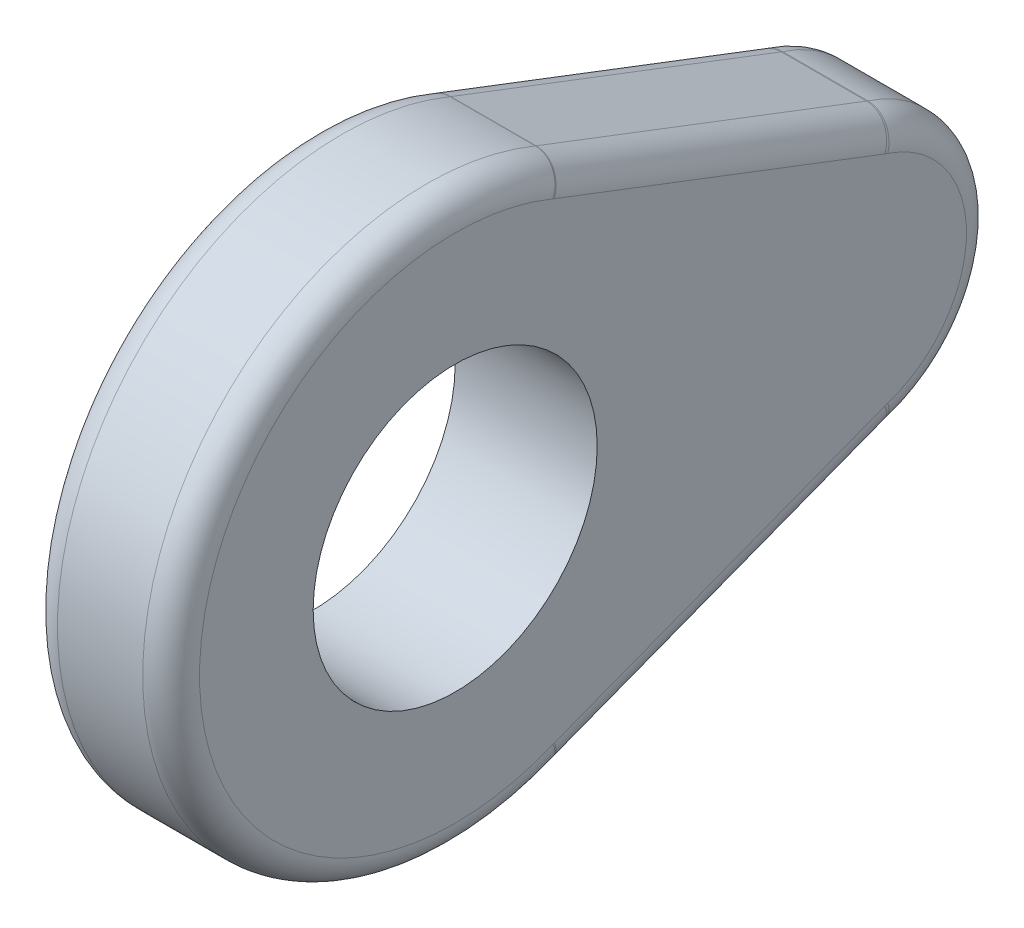
ISO-10303-21;
HEADER;
FILE_DESCRIPTION(('STEP AP214'),'2;1');
FILE_NAME('part.step','',(''),(''),'','','');
FILE_SCHEMA(('AUTOMOTIVE_DESIGN { 1 0 10303 214 1 1 1 1 }'));
ENDSEC;
DATA;
#1=APPLICATION_CONTEXT('core data for automotive mechanical design processes');
#2=APPLICATION_PROTOCOL_DEFINITION('international standard','automotive_design',2000,#1);
#3=PRODUCT_CONTEXT('',#1,'mechanical');
#4=PRODUCT('Part','Part','',(#3));
#5=PRODUCT_RELATED_PRODUCT_CATEGORY('part','',(#4));
#6=PRODUCT_DEFINITION_FORMATION('','',#4);
#7=PRODUCT_DEFINITION_CONTEXT('part definition',#1,'design');
#8=PRODUCT_DEFINITION('design','',#6,#7);
#9=PRODUCT_DEFINITION_SHAPE('','',#8);
#10=(LENGTH_UNIT() NAMED_UNIT(*) SI_UNIT(.MILLI.,.METRE.));
#11=(NAMED_UNIT(*) PLANE_ANGLE_UNIT() SI_UNIT($,.RADIAN.));
#12=(NAMED_UNIT(*) SI_UNIT($,.STERADIAN.) SOLID_ANGLE_UNIT());
#13=UNCERTAINTY_MEASURE_WITH_UNIT(LENGTH_MEASURE(1.E-05),#10,'distance_accuracy_value','');
#14=(GEOMETRIC_REPRESENTATION_CONTEXT(3) GLOBAL_UNCERTAINTY_ASSIGNED_CONTEXT((#13)) GLOBAL_UNIT_ASSIGNED_CONTEXT((#10,
#11,#12)) REPRESENTATION_CONTEXT('',''));
#15=CARTESIAN_POINT('',(0.,0.,0.));
#16=DIRECTION('',(0.,0.,1.));
#17=DIRECTION('',(1.,0.,0.));
#18=AXIS2_PLACEMENT_3D('',#15,#16,#17);
#19=CARTESIAN_POINT('',(0.,0.,0.));
#20=DIRECTION('',(1.,0.,0.));
#21=DIRECTION('',(0.,0.,-1.));
#22=AXIS2_PLACEMENT_3D('',#19,#20,#21);
#23=PLANE('',#22);
#24=CARTESIAN_POINT('',(0.,0.,0.));
#25=DIRECTION('',(1.,0.,0.));
#26=DIRECTION('',(0.,0.,-1.));
#27=AXIS2_PLACEMENT_3D('',#24,#25,#26);
#28=CIRCLE('',#27,5.);
#29=CARTESIAN_POINT('',(0.,0.,-5.));
#30=VERTEX_POINT('',#29);
#31=EDGE_CURVE('E297',#30,#30,#28,.T.);
#32=ORIENTED_EDGE('',*,*,#31,.T.);
#33=EDGE_LOOP('',(#32));
#34=FACE_BOUND('',#33,.T.);
#35=CARTESIAN_POINT('',(0.,-5.71101040658251,-15.8396630495573));
#36=DIRECTION('',(1.,0.,0.));
#37=DIRECTION('',(0.,0.,-1.));
#38=AXIS2_PLACEMENT_3D('',#35,#36,#37);
#39=CIRCLE('',#38,2.);
#40=CARTESIAN_POINT('',(0.,-3.84317430673035,-15.1246887114939));
#41=VERTEX_POINT('',#40);
#42=CARTESIAN_POINT('',(0.,-3.807340271055,-15.2264420330382));
#43=VERTEX_POINT('',#42);
#44=EDGE_CURVE('E214',#41,#43,#39,.F.);
#45=ORIENTED_EDGE('',*,*,#44,.F.);
#46=DIRECTION('',(0.,0.357487169031662,-0.933918049926078));
#47=VECTOR('',#46,1.);
#48=CARTESIAN_POINT('',(0.,-8.40161270135434,-3.21598746286716));
#49=LINE('',#48,#47);
#50=CARTESIAN_POINT('',(0.,-8.29680087797429,-3.48980331467924));
#51=VERTEX_POINT('',#50);
#52=EDGE_CURVE('E211',#41,#51,#49,.F.);
#53=ORIENTED_EDGE('',*,*,#52,.T.);
#54=CARTESIAN_POINT('',(0.,-10.1646369778264,-4.20477765274256));
#55=DIRECTION('',(1.,0.,0.));
#56=DIRECTION('',(0.,0.,-1.));
#57=AXIS2_PLACEMENT_3D('',#54,#55,#56);
#58=CIRCLE('',#57,2.);
#59=CARTESIAN_POINT('',(0.,-8.31652116367618,-3.44027262497118));
#60=VERTEX_POINT('',#59);
#61=EDGE_CURVE('E209',#60,#51,#58,.F.);
#62=ORIENTED_EDGE('',*,*,#61,.F.);
#63=CARTESIAN_POINT('',(0.,0.,0.));
#64=DIRECTION('',(1.,0.,0.));
#65=DIRECTION('',(0.,0.,-1.));
#66=AXIS2_PLACEMENT_3D('',#63,#64,#65);
#67=CIRCLE('',#66,9.);
#68=CARTESIAN_POINT('',(0.,8.31652116367618,-3.44027262497118));
#69=VERTEX_POINT('',#68);
#70=EDGE_CURVE('E207',#60,#69,#67,.F.);
#71=ORIENTED_EDGE('',*,*,#70,.T.);
#72=CARTESIAN_POINT('',(0.,10.1646369778264,-4.20477765274256));
#73=DIRECTION('',(1.,0.,0.));
#74=DIRECTION('',(0.,0.,-1.));
#75=AXIS2_PLACEMENT_3D('',#72,#73,#74);
#76=CIRCLE('',#75,2.);
#77=CARTESIAN_POINT('',(0.,8.29680087797429,-3.48980331467924));
#78=VERTEX_POINT('',#77);
#79=EDGE_CURVE('E204',#78,#69,#76,.F.);
#80=ORIENTED_EDGE('',*,*,#79,.F.);
#81=DIRECTION('',(0.,-0.357487169031662,-0.933918049926078));
#82=VECTOR('',#81,1.);
#83=CARTESIAN_POINT('',(0.,3.83308982371278,-15.151033938764));
#84=LINE('',#83,#82);
#85=CARTESIAN_POINT('',(0.,3.84317430673036,-15.1246887114939));
#86=VERTEX_POINT('',#85);
#87=EDGE_CURVE('E200',#78,#86,#84,.T.);
#88=ORIENTED_EDGE('',*,*,#87,.T.);
#89=CARTESIAN_POINT('',(0.,5.71101040658251,-15.8396630495573));
#90=DIRECTION('',(1.,0.,0.));
#91=DIRECTION('',(0.,0.,-1.));
#92=AXIS2_PLACEMENT_3D('',#89,#90,#91);
#93=CIRCLE('',#92,2.);
#94=CARTESIAN_POINT('',(0.,3.807340271055,-15.2264420330382));
#95=VERTEX_POINT('',#94);
#96=EDGE_CURVE('E197',#95,#86,#93,.F.);
#97=ORIENTED_EDGE('',*,*,#96,.F.);
#98=CARTESIAN_POINT('',(0.,0.,-14.));
#99=DIRECTION('',(1.,0.,0.));
#100=DIRECTION('',(0.,0.,-1.));
#101=AXIS2_PLACEMENT_3D('',#98,#99,#100);
#102=CIRCLE('',#101,4.);
#103=EDGE_CURVE('E202',#95,#43,#102,.F.);
#104=ORIENTED_EDGE('',*,*,#103,.T.);
#105=EDGE_LOOP('',(#45,#53,#62,#71,#80,#88,#97,#104));
#106=FACE_BOUND('',#105,.T.);
#107=ADVANCED_FACE('F35',(#34,#106),#23,.F.);
#108=CARTESIAN_POINT('',(5.,0.,0.));
#109=DIRECTION('',(1.,0.,0.));
#110=DIRECTION('',(0.,0.,-1.));
#111=AXIS2_PLACEMENT_3D('',#108,#109,#110);
#112=PLANE('',#111);
#113=CARTESIAN_POINT('',(5.,0.,0.));
#114=DIRECTION('',(1.,0.,0.));
#115=DIRECTION('',(0.,0.,-1.));
#116=AXIS2_PLACEMENT_3D('',#113,#114,#115);
#117=CIRCLE('',#116,5.);
#118=CARTESIAN_POINT('',(5.,0.,-5.));
#119=VERTEX_POINT('',#118);
#120=EDGE_CURVE('E157',#119,#119,#117,.T.);
#121=ORIENTED_EDGE('',*,*,#120,.F.);
#122=EDGE_LOOP('',(#121));
#123=FACE_BOUND('',#122,.T.);
#124=CARTESIAN_POINT('',(5.,-10.1646369778264,-4.20477765274256));
#125=DIRECTION('',(1.,0.,0.));
#126=DIRECTION('',(0.,0.,-1.));
#127=AXIS2_PLACEMENT_3D('',#124,#125,#126);
#128=CIRCLE('',#127,2.);
#129=CARTESIAN_POINT('',(5.,-8.29680087797429,-3.48980331467924));
#130=VERTEX_POINT('',#129);
#131=CARTESIAN_POINT('',(5.,-8.31652116367618,-3.44027262497118));
#132=VERTEX_POINT('',#131);
#133=EDGE_CURVE('E186',#130,#132,#128,.T.);
#134=ORIENTED_EDGE('',*,*,#133,.F.);
#135=DIRECTION('',(0.,0.357487169031662,-0.933918049926078));
#136=VECTOR('',#135,1.);
#137=CARTESIAN_POINT('',(5.,-3.83308982371278,-15.151033938764));
#138=LINE('',#137,#136);
#139=CARTESIAN_POINT('',(5.,-3.84317430673036,-15.1246887114939));
#140=VERTEX_POINT('',#139);
#141=EDGE_CURVE('E178',#130,#140,#138,.T.);
#142=ORIENTED_EDGE('',*,*,#141,.T.);
#143=CARTESIAN_POINT('',(5.,-5.71101040658251,-15.8396630495573));
#144=DIRECTION('',(1.,0.,0.));
#145=DIRECTION('',(0.,0.,-1.));
#146=AXIS2_PLACEMENT_3D('',#143,#144,#145);
#147=CIRCLE('',#146,2.);
#148=CARTESIAN_POINT('',(5.,-3.807340271055,-15.2264420330382));
#149=VERTEX_POINT('',#148);
#150=EDGE_CURVE('E174',#149,#140,#147,.T.);
#151=ORIENTED_EDGE('',*,*,#150,.F.);
#152=CARTESIAN_POINT('',(5.,0.,-14.));
#153=DIRECTION('',(1.,0.,0.));
#154=DIRECTION('',(0.,0.,-1.));
#155=AXIS2_PLACEMENT_3D('',#152,#153,#154);
#156=CIRCLE('',#155,4.);
#157=CARTESIAN_POINT('',(5.,3.807340271055,-15.2264420330382));
#158=VERTEX_POINT('',#157);
#159=EDGE_CURVE('E175',#149,#158,#156,.T.);
#160=ORIENTED_EDGE('',*,*,#159,.T.);
#161=CARTESIAN_POINT('',(5.,5.71101040658251,-15.8396630495573));
#162=DIRECTION('',(1.,0.,0.));
#163=DIRECTION('',(0.,0.,-1.));
#164=AXIS2_PLACEMENT_3D('',#161,#162,#163);
#165=CIRCLE('',#164,2.);
#166=CARTESIAN_POINT('',(5.,3.84317430673035,-15.1246887114939));
#167=VERTEX_POINT('',#166);
#168=EDGE_CURVE('E180',#167,#158,#165,.T.);
#169=ORIENTED_EDGE('',*,*,#168,.F.);
#170=DIRECTION('',(0.,-0.357487169031662,-0.933918049926078));
#171=VECTOR('',#170,1.);
#172=CARTESIAN_POINT('',(5.,8.40161270135434,-3.21598746286716));
#173=LINE('',#172,#171);
#174=CARTESIAN_POINT('',(5.,8.29680087797429,-3.48980331467924));
#175=VERTEX_POINT('',#174);
#176=EDGE_CURVE('E154',#167,#175,#173,.F.);
#177=ORIENTED_EDGE('',*,*,#176,.T.);
#178=CARTESIAN_POINT('',(5.,10.1646369778264,-4.20477765274256));
#179=DIRECTION('',(1.,0.,0.));
#180=DIRECTION('',(0.,0.,-1.));
#181=AXIS2_PLACEMENT_3D('',#178,#179,#180);
#182=CIRCLE('',#181,2.);
#183=CARTESIAN_POINT('',(5.,8.31652116367618,-3.44027262497118));
#184=VERTEX_POINT('',#183);
#185=EDGE_CURVE('E147',#184,#175,#182,.T.);
#186=ORIENTED_EDGE('',*,*,#185,.F.);
#187=CARTESIAN_POINT('',(5.,0.,0.));
#188=DIRECTION('',(1.,0.,0.));
#189=DIRECTION('',(0.,0.,-1.));
#190=AXIS2_PLACEMENT_3D('',#187,#188,#189);
#191=CIRCLE('',#190,9.);
#192=EDGE_CURVE('E151',#184,#132,#191,.T.);
#193=ORIENTED_EDGE('',*,*,#192,.T.);
#194=EDGE_LOOP('',(#134,#142,#151,#160,#169,#177,#186,#193));
#195=FACE_BOUND('',#194,.T.);
#196=ADVANCED_FACE('F149',(#123,#195),#112,.T.);
#197=CARTESIAN_POINT('',(5.,-9.33553075128042,-3.57347463189882));
#198=DIRECTION('',(0.,0.933918049926078,0.357487169031662));
#199=DIRECTION('',(0.,-0.357487169031662,0.933918049926078));
#200=AXIS2_PLACEMENT_3D('',#197,#198,#199);
#201=PLANE('',#200);
#202=DIRECTION('',(0.,0.357487169031662,-0.933918049926078));
#203=VECTOR('',#202,1.);
#204=CARTESIAN_POINT('',(4.,-9.23559748653462,-3.83454548371973));
#205=LINE('',#204,#203);
#206=CARTESIAN_POINT('',(4.,-4.77709235665643,-15.4821758805256));
#207=VERTEX_POINT('',#206);
#208=CARTESIAN_POINT('',(4.,-9.23071892790037,-3.8472904837109));
#209=VERTEX_POINT('',#208);
#210=EDGE_CURVE('E192',#207,#209,#205,.F.);
#211=ORIENTED_EDGE('',*,*,#210,.T.);
#212=DIRECTION('',(1.,0.,0.));
#213=VECTOR('',#212,1.);
#214=CARTESIAN_POINT('',(0.,-9.23071892790037,-3.8472904837109));
#215=LINE('',#214,#213);
#216=CARTESIAN_POINT('',(1.,-9.23071892790037,-3.8472904837109));
#217=VERTEX_POINT('',#216);
#218=EDGE_CURVE('E195',#209,#217,#215,.F.);
#219=ORIENTED_EDGE('',*,*,#218,.T.);
#220=DIRECTION('',(0.,0.357487169031662,-0.933918049926078));
#221=VECTOR('',#220,1.);
#222=CARTESIAN_POINT('',(1.,-9.33553075128042,-3.57347463189882));
#223=LINE('',#222,#221);
#224=CARTESIAN_POINT('',(1.,-4.77709235665643,-15.4821758805256));
#225=VERTEX_POINT('',#224);
#226=EDGE_CURVE('E190',#217,#225,#223,.T.);
#227=ORIENTED_EDGE('',*,*,#226,.T.);
#228=DIRECTION('',(1.,0.,0.));
#229=VECTOR('',#228,1.);
#230=CARTESIAN_POINT('',(5.,-4.77709235665643,-15.4821758805256));
#231=LINE('',#230,#229);
#232=EDGE_CURVE('E188',#225,#207,#231,.T.);
#233=ORIENTED_EDGE('',*,*,#232,.T.);
#234=EDGE_LOOP('',(#211,#219,#227,#233));
#235=FACE_BOUND('',#234,.T.);
#236=ADVANCED_FACE('F330',(#235),#201,.F.);
#237=CARTESIAN_POINT('',(5.,0.,-14.));
#238=DIRECTION('',(-1.,0.,0.));
#239=DIRECTION('',(0.,0.,1.));
#240=AXIS2_PLACEMENT_3D('',#237,#238,#239);
#241=CYLINDRICAL_SURFACE('',#240,5.);
#242=CARTESIAN_POINT('',(4.,0.,-14.));
#243=DIRECTION('',(1.,0.,0.));
#244=DIRECTION('',(0.,0.,-1.));
#245=AXIS2_PLACEMENT_3D('',#242,#243,#244);
#246=CIRCLE('',#245,5.);
#247=CARTESIAN_POINT('',(4.,4.75917533881876,-15.5330525412977));
#248=VERTEX_POINT('',#247);
#249=CARTESIAN_POINT('',(4.,-4.75917533881876,-15.5330525412977));
#250=VERTEX_POINT('',#249);
#251=EDGE_CURVE('E44',#248,#250,#246,.F.);
#252=ORIENTED_EDGE('',*,*,#251,.T.);
#253=DIRECTION('',(-1.,0.,0.));
#254=VECTOR('',#253,1.);
#255=CARTESIAN_POINT('',(5.,-4.75917533881876,-15.5330525412977));
#256=LINE('',#255,#254);
#257=CARTESIAN_POINT('',(1.,-4.75917533881876,-15.5330525412977));
#258=VERTEX_POINT('',#257);
#259=EDGE_CURVE('E11',#250,#258,#256,.T.);
#260=ORIENTED_EDGE('',*,*,#259,.T.);
#261=CARTESIAN_POINT('',(1.,0.,-14.));
#262=DIRECTION('',(1.,0.,0.));
#263=DIRECTION('',(0.,0.,-1.));
#264=AXIS2_PLACEMENT_3D('',#261,#262,#263);
#265=CIRCLE('',#264,5.);
#266=CARTESIAN_POINT('',(1.,4.75917533881876,-15.5330525412977));
#267=VERTEX_POINT('',#266);
#268=EDGE_CURVE('E235',#258,#267,#265,.T.);
#269=ORIENTED_EDGE('',*,*,#268,.T.);
#270=DIRECTION('',(-1.,0.,0.));
#271=VECTOR('',#270,1.);
#272=CARTESIAN_POINT('',(5.,4.75917533881876,-15.5330525412977));
#273=LINE('',#272,#271);
#274=EDGE_CURVE('E55',#267,#248,#273,.F.);
#275=ORIENTED_EDGE('',*,*,#274,.T.);
#276=EDGE_LOOP('',(#252,#260,#269,#275));
#277=FACE_BOUND('',#276,.T.);
#278=ADVANCED_FACE('F347',(#277),#241,.T.);
#279=CARTESIAN_POINT('',(5.,9.33553075128042,-3.57347463189882));
#280=DIRECTION('',(0.,0.933918049926078,-0.357487169031662));
#281=DIRECTION('',(0.,0.357487169031662,0.933918049926078));
#282=AXIS2_PLACEMENT_3D('',#279,#280,#281);
#283=PLANE('',#282);
#284=DIRECTION('',(-1.,0.,0.));
#285=VECTOR('',#284,1.);
#286=CARTESIAN_POINT('',(5.,4.77709235665643,-15.4821758805256));
#287=LINE('',#286,#285);
#288=CARTESIAN_POINT('',(4.,4.77709235665643,-15.4821758805256));
#289=VERTEX_POINT('',#288);
#290=CARTESIAN_POINT('',(1.,4.77709235665643,-15.4821758805256));
#291=VERTEX_POINT('',#290);
#292=EDGE_CURVE('E228',#289,#291,#287,.T.);
#293=ORIENTED_EDGE('',*,*,#292,.T.);
#294=DIRECTION('',(0.,-0.357487169031662,-0.933918049926078));
#295=VECTOR('',#294,1.);
#296=CARTESIAN_POINT('',(1.,9.23559748653462,-3.83454548371973));
#297=LINE('',#296,#295);
#298=CARTESIAN_POINT('',(1.,9.23071892790037,-3.8472904837109));
#299=VERTEX_POINT('',#298);
#300=EDGE_CURVE('E233',#291,#299,#297,.F.);
#301=ORIENTED_EDGE('',*,*,#300,.T.);
#302=DIRECTION('',(-1.,0.,0.));
#303=VECTOR('',#302,1.);
#304=CARTESIAN_POINT('',(5.,9.23071892790037,-3.8472904837109));
#305=LINE('',#304,#303);
#306=CARTESIAN_POINT('',(4.,9.23071892790037,-3.8472904837109));
#307=VERTEX_POINT('',#306);
#308=EDGE_CURVE('E230',#299,#307,#305,.F.);
#309=ORIENTED_EDGE('',*,*,#308,.T.);
#310=DIRECTION('',(0.,-0.357487169031662,-0.933918049926078));
#311=VECTOR('',#310,1.);
#312=CARTESIAN_POINT('',(4.,9.33553075128042,-3.57347463189882));
#313=LINE('',#312,#311);
#314=EDGE_CURVE('E226',#307,#289,#313,.T.);
#315=ORIENTED_EDGE('',*,*,#314,.T.);
#316=EDGE_LOOP('',(#293,#301,#309,#315));
#317=FACE_BOUND('',#316,.T.);
#318=ADVANCED_FACE('F349',(#317),#283,.T.);
#319=CARTESIAN_POINT('',(5.,0.,0.));
#320=DIRECTION('',(-1.,0.,0.));
#321=DIRECTION('',(0.,0.,1.));
#322=AXIS2_PLACEMENT_3D('',#319,#320,#321);
#323=CYLINDRICAL_SURFACE('',#322,10.);
#324=CARTESIAN_POINT('',(4.,0.,0.));
#325=DIRECTION('',(1.,0.,0.));
#326=DIRECTION('',(0.,0.,-1.));
#327=AXIS2_PLACEMENT_3D('',#324,#325,#326);
#328=CIRCLE('',#327,10.);
#329=CARTESIAN_POINT('',(4.,-9.24057907075131,-3.82252513885687));
#330=VERTEX_POINT('',#329);
#331=CARTESIAN_POINT('',(4.,9.24057907075131,-3.82252513885687));
#332=VERTEX_POINT('',#331);
#333=EDGE_CURVE('E221',#330,#332,#328,.F.);
#334=ORIENTED_EDGE('',*,*,#333,.T.);
#335=DIRECTION('',(-1.,0.,0.));
#336=VECTOR('',#335,1.);
#337=CARTESIAN_POINT('',(5.,9.24057907075131,-3.82252513885687));
#338=LINE('',#337,#336);
#339=CARTESIAN_POINT('',(1.,9.24057907075131,-3.82252513885687));
#340=VERTEX_POINT('',#339);
#341=EDGE_CURVE('E223',#332,#340,#338,.T.);
#342=ORIENTED_EDGE('',*,*,#341,.T.);
#343=CARTESIAN_POINT('',(1.,0.,0.));
#344=DIRECTION('',(1.,0.,0.));
#345=DIRECTION('',(0.,0.,-1.));
#346=AXIS2_PLACEMENT_3D('',#343,#344,#345);
#347=CIRCLE('',#346,10.);
#348=CARTESIAN_POINT('',(1.,-9.24057907075131,-3.82252513885687));
#349=VERTEX_POINT('',#348);
#350=EDGE_CURVE('E217',#340,#349,#347,.T.);
#351=ORIENTED_EDGE('',*,*,#350,.T.);
#352=DIRECTION('',(-1.,0.,0.));
#353=VECTOR('',#352,1.);
#354=CARTESIAN_POINT('',(5.,-9.24057907075131,-3.82252513885687));
#355=LINE('',#354,#353);
#356=EDGE_CURVE('E219',#349,#330,#355,.F.);
#357=ORIENTED_EDGE('',*,*,#356,.T.);
#358=EDGE_LOOP('',(#334,#342,#351,#357));
#359=FACE_BOUND('',#358,.T.);
#360=ADVANCED_FACE('F355',(#359),#323,.T.);
#361=CARTESIAN_POINT('',(5.,0.,0.));
#362=DIRECTION('',(-1.,0.,0.));
#363=DIRECTION('',(0.,0.,1.));
#364=AXIS2_PLACEMENT_3D('',#361,#362,#363);
#365=CYLINDRICAL_SURFACE('',#364,5.);
#366=ORIENTED_EDGE('',*,*,#120,.T.);
#367=EDGE_LOOP('',(#366));
#368=FACE_BOUND('',#367,.T.);
#369=ORIENTED_EDGE('',*,*,#31,.F.);
#370=EDGE_LOOP('',(#369));
#371=FACE_BOUND('',#370,.T.);
#372=ADVANCED_FACE('F368',(#368,#371),#365,.F.);
#373=CARTESIAN_POINT('',(1.,8.40161270135434,-3.21598746286716));
#374=DIRECTION('',(0.,0.357487169031662,0.933918049926078));
#375=DIRECTION('',(0.,-0.933918049926078,0.357487169031662));
#376=AXIS2_PLACEMENT_3D('',#373,#374,#375);
#377=CYLINDRICAL_SURFACE('',#376,1.);
#378=CARTESIAN_POINT('',(1.,3.84317430673036,-15.1246887114939));
#379=DIRECTION('',(0.,-0.357487169031661,-0.933918049926078));
#380=DIRECTION('',(0.,0.933918049926078,-0.357487169031661));
#381=AXIS2_PLACEMENT_3D('',#378,#379,#380);
#382=CIRCLE('',#381,1.);
#383=EDGE_CURVE('E291',#86,#291,#382,.T.);
#384=ORIENTED_EDGE('',*,*,#383,.F.);
#385=ORIENTED_EDGE('',*,*,#87,.F.);
#386=CARTESIAN_POINT('',(1.,8.29680087797429,-3.48980331467924));
#387=DIRECTION('',(0.,0.357487169031662,0.933918049926078));
#388=DIRECTION('',(0.,-0.933918049926078,0.357487169031662));
#389=AXIS2_PLACEMENT_3D('',#386,#387,#388);
#390=CIRCLE('',#389,1.);
#391=EDGE_CURVE('E39',#299,#78,#390,.T.);
#392=ORIENTED_EDGE('',*,*,#391,.F.);
#393=ORIENTED_EDGE('',*,*,#300,.F.);
#394=EDGE_LOOP('',(#384,#385,#392,#393));
#395=FACE_BOUND('',#394,.T.);
#396=ADVANCED_FACE('F37',(#395),#377,.T.);
#397=CARTESIAN_POINT('',(1.,10.1646369778264,-4.20477765274256));
#398=DIRECTION('',(1.,0.,0.));
#399=DIRECTION('',(0.,0.,-1.));
#400=AXIS2_PLACEMENT_3D('',#397,#398,#399);
#401=TOROIDAL_SURFACE('',#400,2.,1.);
#402=ORIENTED_EDGE('',*,*,#391,.T.);
#403=ORIENTED_EDGE('',*,*,#79,.T.);
#404=CARTESIAN_POINT('',(1.,8.31652116367618,-3.44027262497118));
#405=DIRECTION('',(0.,-0.382252513885687,-0.924057907075131));
#406=DIRECTION('',(0.,0.924057907075132,-0.382252513885687));
#407=AXIS2_PLACEMENT_3D('',#404,#405,#406);
#408=CIRCLE('',#407,1.);
#409=EDGE_CURVE('E289',#340,#69,#408,.F.);
#410=ORIENTED_EDGE('',*,*,#409,.F.);
#411=CARTESIAN_POINT('',(1.,10.1646369778264,-4.20477765274256));
#412=DIRECTION('',(1.,0.,0.));
#413=DIRECTION('',(0.,0.,-1.));
#414=AXIS2_PLACEMENT_3D('',#411,#412,#413);
#415=CIRCLE('',#414,1.);
#416=EDGE_CURVE('E286',#299,#340,#415,.F.);
#417=ORIENTED_EDGE('',*,*,#416,.F.);
#418=EDGE_LOOP('',(#402,#403,#410,#417));
#419=FACE_BOUND('',#418,.T.);
#420=ADVANCED_FACE('F384',(#419),#401,.T.);
#421=CARTESIAN_POINT('',(1.,5.71101040658251,-15.8396630495573));
#422=DIRECTION('',(1.,0.,0.));
#423=DIRECTION('',(0.,0.,-1.));
#424=AXIS2_PLACEMENT_3D('',#421,#422,#423);
#425=TOROIDAL_SURFACE('',#424,2.,1.);
#426=ORIENTED_EDGE('',*,*,#96,.T.);
#427=ORIENTED_EDGE('',*,*,#383,.T.);
#428=CARTESIAN_POINT('',(1.,5.71101040658251,-15.8396630495573));
#429=DIRECTION('',(1.,0.,0.));
#430=DIRECTION('',(0.,0.,-1.));
#431=AXIS2_PLACEMENT_3D('',#428,#429,#430);
#432=CIRCLE('',#431,1.);
#433=EDGE_CURVE('E283',#267,#291,#432,.F.);
#434=ORIENTED_EDGE('',*,*,#433,.F.);
#435=CARTESIAN_POINT('',(1.,3.807340271055,-15.2264420330382));
#436=DIRECTION('',(0.,0.306610508259543,0.951835067763751));
#437=DIRECTION('',(0.,-0.951835067763751,0.306610508259543));
#438=AXIS2_PLACEMENT_3D('',#435,#436,#437);
#439=CIRCLE('',#438,1.);
#440=EDGE_CURVE('E280',#95,#267,#439,.F.);
#441=ORIENTED_EDGE('',*,*,#440,.F.);
#442=EDGE_LOOP('',(#426,#427,#434,#441));
#443=FACE_BOUND('',#442,.T.);
#444=ADVANCED_FACE('F436',(#443),#425,.T.);
#445=CARTESIAN_POINT('',(1.,0.,0.));
#446=DIRECTION('',(1.,0.,0.));
#447=DIRECTION('',(0.,0.,-1.));
#448=AXIS2_PLACEMENT_3D('',#445,#446,#447);
#449=TOROIDAL_SURFACE('',#448,9.,1.);
#450=ORIENTED_EDGE('',*,*,#409,.T.);
#451=ORIENTED_EDGE('',*,*,#70,.F.);
#452=CARTESIAN_POINT('',(1.,-8.31652116367618,-3.44027262497118));
#453=DIRECTION('',(0.,0.382252513885687,-0.924057907075131));
#454=DIRECTION('',(0.,0.924057907075132,0.382252513885687));
#455=AXIS2_PLACEMENT_3D('',#452,#453,#454);
#456=CIRCLE('',#455,1.);
#457=EDGE_CURVE('E274',#349,#60,#456,.T.);
#458=ORIENTED_EDGE('',*,*,#457,.F.);
#459=ORIENTED_EDGE('',*,*,#350,.F.);
#460=EDGE_LOOP('',(#450,#451,#458,#459));
#461=FACE_BOUND('',#460,.T.);
#462=ADVANCED_FACE('F387',(#461),#449,.T.);
#463=CARTESIAN_POINT('',(5.,10.1646369778264,-4.20477765274256));
#464=DIRECTION('',(-1.,0.,0.));
#465=DIRECTION('',(0.,0.,1.));
#466=AXIS2_PLACEMENT_3D('',#463,#464,#465);
#467=CYLINDRICAL_SURFACE('',#466,1.);
#468=ORIENTED_EDGE('',*,*,#416,.T.);
#469=ORIENTED_EDGE('',*,*,#341,.F.);
#470=CARTESIAN_POINT('',(4.,10.1646369778264,-4.20477765274256));
#471=DIRECTION('',(1.,0.,0.));
#472=DIRECTION('',(0.,0.,-1.));
#473=AXIS2_PLACEMENT_3D('',#470,#471,#472);
#474=CIRCLE('',#473,1.);
#475=EDGE_CURVE('E164',#307,#332,#474,.F.);
#476=ORIENTED_EDGE('',*,*,#475,.F.);
#477=ORIENTED_EDGE('',*,*,#308,.F.);
#478=EDGE_LOOP('',(#468,#469,#476,#477));
#479=FACE_BOUND('',#478,.T.);
#480=ADVANCED_FACE('F380',(#479),#467,.F.);
#481=CARTESIAN_POINT('',(4.,8.40161270135434,-3.21598746286716));
#482=DIRECTION('',(0.,-0.357487169031662,-0.933918049926078));
#483=DIRECTION('',(0.,0.933918049926078,-0.357487169031662));
#484=AXIS2_PLACEMENT_3D('',#481,#482,#483);
#485=CYLINDRICAL_SURFACE('',#484,1.);
#486=CARTESIAN_POINT('',(4.,3.84317430673035,-15.1246887114939));
#487=DIRECTION('',(0.,-0.357487169031662,-0.933918049926078));
#488=DIRECTION('',(0.,0.933918049926078,-0.357487169031662));
#489=AXIS2_PLACEMENT_3D('',#486,#487,#488);
#490=CIRCLE('',#489,1.);
#491=EDGE_CURVE('E268',#289,#167,#490,.T.);
#492=ORIENTED_EDGE('',*,*,#491,.F.);
#493=ORIENTED_EDGE('',*,*,#314,.F.);
#494=CARTESIAN_POINT('',(4.,8.29680087797429,-3.48980331467924));
#495=DIRECTION('',(0.,0.357487169031662,0.933918049926078));
#496=DIRECTION('',(0.,-0.933918049926078,0.357487169031662));
#497=AXIS2_PLACEMENT_3D('',#494,#495,#496);
#498=CIRCLE('',#497,1.);
#499=EDGE_CURVE('E271',#175,#307,#498,.T.);
#500=ORIENTED_EDGE('',*,*,#499,.F.);
#501=ORIENTED_EDGE('',*,*,#176,.F.);
#502=EDGE_LOOP('',(#492,#493,#500,#501));
#503=FACE_BOUND('',#502,.T.);
#504=ADVANCED_FACE('F427',(#503),#485,.T.);
#505=CARTESIAN_POINT('',(5.,5.71101040658251,-15.8396630495573));
#506=DIRECTION('',(-1.,0.,0.));
#507=DIRECTION('',(0.,0.,1.));
#508=AXIS2_PLACEMENT_3D('',#505,#506,#507);
#509=CYLINDRICAL_SURFACE('',#508,1.);
#510=ORIENTED_EDGE('',*,*,#433,.T.);
#511=ORIENTED_EDGE('',*,*,#292,.F.);
#512=CARTESIAN_POINT('',(4.,5.71101040658251,-15.8396630495573));
#513=DIRECTION('',(1.,0.,0.));
#514=DIRECTION('',(0.,0.,-1.));
#515=AXIS2_PLACEMENT_3D('',#512,#513,#514);
#516=CIRCLE('',#515,1.);
#517=EDGE_CURVE('E265',#248,#289,#516,.F.);
#518=ORIENTED_EDGE('',*,*,#517,.F.);
#519=ORIENTED_EDGE('',*,*,#274,.F.);
#520=EDGE_LOOP('',(#510,#511,#518,#519));
#521=FACE_BOUND('',#520,.T.);
#522=ADVANCED_FACE('F424',(#521),#509,.F.);
#523=CARTESIAN_POINT('',(1.,0.,-14.));
#524=DIRECTION('',(1.,0.,0.));
#525=DIRECTION('',(0.,0.,-1.));
#526=AXIS2_PLACEMENT_3D('',#523,#524,#525);
#527=TOROIDAL_SURFACE('',#526,4.,1.);
#528=ORIENTED_EDGE('',*,*,#440,.T.);
#529=ORIENTED_EDGE('',*,*,#268,.F.);
#530=CARTESIAN_POINT('',(1.,-3.807340271055,-15.2264420330382));
#531=DIRECTION('',(0.,-0.306610508259543,0.951835067763751));
#532=DIRECTION('',(0.,-0.951835067763751,-0.306610508259543));
#533=AXIS2_PLACEMENT_3D('',#530,#531,#532);
#534=CIRCLE('',#533,1.);
#535=EDGE_CURVE('E262',#43,#258,#534,.T.);
#536=ORIENTED_EDGE('',*,*,#535,.F.);
#537=ORIENTED_EDGE('',*,*,#103,.F.);
#538=EDGE_LOOP('',(#528,#529,#536,#537));
#539=FACE_BOUND('',#538,.T.);
#540=ADVANCED_FACE('F345',(#539),#527,.T.);
#541=CARTESIAN_POINT('',(1.,-8.40161270135434,-3.21598746286716));
#542=DIRECTION('',(0.,0.357487169031662,-0.933918049926078));
#543=DIRECTION('',(0.,0.933918049926078,0.357487169031662));
#544=AXIS2_PLACEMENT_3D('',#541,#542,#543);
#545=CYLINDRICAL_SURFACE('',#544,1.);
#546=CARTESIAN_POINT('',(1.,-8.29680087797429,-3.48980331467924));
#547=DIRECTION('',(0.,-0.357487169031662,0.933918049926078));
#548=DIRECTION('',(0.,-0.933918049926078,-0.357487169031662));
#549=AXIS2_PLACEMENT_3D('',#546,#547,#548);
#550=CIRCLE('',#549,1.);
#551=EDGE_CURVE('E277',#51,#217,#550,.T.);
#552=ORIENTED_EDGE('',*,*,#551,.F.);
#553=ORIENTED_EDGE('',*,*,#52,.F.);
#554=CARTESIAN_POINT('',(1.,-3.84317430673035,-15.1246887114939));
#555=DIRECTION('',(0.,0.357487169031662,-0.933918049926078));
#556=DIRECTION('',(0.,0.933918049926078,0.357487169031662));
#557=AXIS2_PLACEMENT_3D('',#554,#555,#556);
#558=CIRCLE('',#557,1.);
#559=EDGE_CURVE('E259',#225,#41,#558,.T.);
#560=ORIENTED_EDGE('',*,*,#559,.F.);
#561=ORIENTED_EDGE('',*,*,#226,.F.);
#562=EDGE_LOOP('',(#552,#553,#560,#561));
#563=FACE_BOUND('',#562,.T.);
#564=ADVANCED_FACE('F338',(#563),#545,.T.);
#565=CARTESIAN_POINT('',(1.,-10.1646369778264,-4.20477765274256));
#566=DIRECTION('',(1.,0.,0.));
#567=DIRECTION('',(0.,0.,-1.));
#568=AXIS2_PLACEMENT_3D('',#565,#566,#567);
#569=TOROIDAL_SURFACE('',#568,2.,1.);
#570=ORIENTED_EDGE('',*,*,#61,.T.);
#571=ORIENTED_EDGE('',*,*,#551,.T.);
#572=CARTESIAN_POINT('',(1.,-10.1646369778264,-4.20477765274256));
#573=DIRECTION('',(1.,0.,0.));
#574=DIRECTION('',(0.,0.,-1.));
#575=AXIS2_PLACEMENT_3D('',#572,#573,#574);
#576=CIRCLE('',#575,1.);
#577=EDGE_CURVE('E167',#349,#217,#576,.F.);
#578=ORIENTED_EDGE('',*,*,#577,.F.);
#579=ORIENTED_EDGE('',*,*,#457,.T.);
#580=EDGE_LOOP('',(#570,#571,#578,#579));
#581=FACE_BOUND('',#580,.T.);
#582=ADVANCED_FACE('F391',(#581),#569,.T.);
#583=CARTESIAN_POINT('',(4.,10.1646369778264,-4.20477765274256));
#584=DIRECTION('',(1.,0.,0.));
#585=DIRECTION('',(0.,0.,-1.));
#586=AXIS2_PLACEMENT_3D('',#583,#584,#585);
#587=TOROIDAL_SURFACE('',#586,2.,1.);
#588=ORIENTED_EDGE('',*,*,#499,.T.);
#589=ORIENTED_EDGE('',*,*,#475,.T.);
#590=CARTESIAN_POINT('',(4.,8.31652116367618,-3.44027262497118));
#591=DIRECTION('',(0.,-0.382252513885687,-0.924057907075131));
#592=DIRECTION('',(0.,0.924057907075132,-0.382252513885687));
#593=AXIS2_PLACEMENT_3D('',#590,#591,#592);
#594=CIRCLE('',#593,1.);
#595=EDGE_CURVE('E161',#184,#332,#594,.F.);
#596=ORIENTED_EDGE('',*,*,#595,.F.);
#597=ORIENTED_EDGE('',*,*,#185,.T.);
#598=EDGE_LOOP('',(#588,#589,#596,#597));
#599=FACE_BOUND('',#598,.T.);
#600=ADVANCED_FACE('F162',(#599),#587,.T.);
#601=CARTESIAN_POINT('',(4.,5.71101040658251,-15.8396630495573));
#602=DIRECTION('',(1.,0.,0.));
#603=DIRECTION('',(0.,0.,-1.));
#604=AXIS2_PLACEMENT_3D('',#601,#602,#603);
#605=TOROIDAL_SURFACE('',#604,2.,1.);
#606=ORIENTED_EDGE('',*,*,#491,.T.);
#607=ORIENTED_EDGE('',*,*,#168,.T.);
#608=CARTESIAN_POINT('',(4.,3.807340271055,-15.2264420330382));
#609=DIRECTION('',(0.,0.306610508259543,0.951835067763751));
#610=DIRECTION('',(0.,-0.951835067763751,0.306610508259543));
#611=AXIS2_PLACEMENT_3D('',#608,#609,#610);
#612=CIRCLE('',#611,1.);
#613=EDGE_CURVE('E168',#248,#158,#612,.F.);
#614=ORIENTED_EDGE('',*,*,#613,.F.);
#615=ORIENTED_EDGE('',*,*,#517,.T.);
#616=EDGE_LOOP('',(#606,#607,#614,#615));
#617=FACE_BOUND('',#616,.T.);
#618=ADVANCED_FACE('F311',(#617),#605,.T.);
#619=CARTESIAN_POINT('',(1.,-5.71101040658251,-15.8396630495573));
#620=DIRECTION('',(1.,0.,0.));
#621=DIRECTION('',(0.,0.,-1.));
#622=AXIS2_PLACEMENT_3D('',#619,#620,#621);
#623=TOROIDAL_SURFACE('',#622,2.,1.);
#624=ORIENTED_EDGE('',*,*,#44,.T.);
#625=ORIENTED_EDGE('',*,*,#535,.T.);
#626=CARTESIAN_POINT('',(1.,-5.71101040658251,-15.8396630495573));
#627=DIRECTION('',(1.,0.,0.));
#628=DIRECTION('',(0.,0.,-1.));
#629=AXIS2_PLACEMENT_3D('',#626,#627,#628);
#630=CIRCLE('',#629,1.);
#631=EDGE_CURVE('E253',#225,#258,#630,.F.);
#632=ORIENTED_EDGE('',*,*,#631,.F.);
#633=ORIENTED_EDGE('',*,*,#559,.T.);
#634=EDGE_LOOP('',(#624,#625,#632,#633));
#635=FACE_BOUND('',#634,.T.);
#636=ADVANCED_FACE('F340',(#635),#623,.T.);
#637=CARTESIAN_POINT('',(5.,-10.1646369778264,-4.20477765274256));
#638=DIRECTION('',(-1.,0.,0.));
#639=DIRECTION('',(0.,0.,1.));
#640=AXIS2_PLACEMENT_3D('',#637,#638,#639);
#641=CYLINDRICAL_SURFACE('',#640,1.);
#642=ORIENTED_EDGE('',*,*,#577,.T.);
#643=ORIENTED_EDGE('',*,*,#218,.F.);
#644=CARTESIAN_POINT('',(4.,-10.1646369778264,-4.20477765274256));
#645=DIRECTION('',(1.,0.,0.));
#646=DIRECTION('',(0.,0.,-1.));
#647=AXIS2_PLACEMENT_3D('',#644,#645,#646);
#648=CIRCLE('',#647,1.);
#649=EDGE_CURVE('E250',#330,#209,#648,.F.);
#650=ORIENTED_EDGE('',*,*,#649,.F.);
#651=ORIENTED_EDGE('',*,*,#356,.F.);
#652=EDGE_LOOP('',(#642,#643,#650,#651));
#653=FACE_BOUND('',#652,.T.);
#654=ADVANCED_FACE('F393',(#653),#641,.F.);
#655=CARTESIAN_POINT('',(4.,0.,0.));
#656=DIRECTION('',(1.,0.,0.));
#657=DIRECTION('',(0.,0.,-1.));
#658=AXIS2_PLACEMENT_3D('',#655,#656,#657);
#659=TOROIDAL_SURFACE('',#658,9.,1.);
#660=ORIENTED_EDGE('',*,*,#595,.T.);
#661=ORIENTED_EDGE('',*,*,#333,.F.);
#662=CARTESIAN_POINT('',(4.,-8.31652116367618,-3.44027262497118));
#663=DIRECTION('',(0.,0.382252513885688,-0.924057907075131));
#664=DIRECTION('',(0.,0.924057907075131,0.382252513885688));
#665=AXIS2_PLACEMENT_3D('',#662,#663,#664);
#666=CIRCLE('',#665,1.);
#667=EDGE_CURVE('E172',#132,#330,#666,.T.);
#668=ORIENTED_EDGE('',*,*,#667,.F.);
#669=ORIENTED_EDGE('',*,*,#192,.F.);
#670=EDGE_LOOP('',(#660,#661,#668,#669));
#671=FACE_BOUND('',#670,.T.);
#672=ADVANCED_FACE('F170',(#671),#659,.T.);
#673=CARTESIAN_POINT('',(4.,0.,-14.));
#674=DIRECTION('',(1.,0.,0.));
#675=DIRECTION('',(0.,0.,-1.));
#676=AXIS2_PLACEMENT_3D('',#673,#674,#675);
#677=TOROIDAL_SURFACE('',#676,4.,1.);
#678=ORIENTED_EDGE('',*,*,#613,.T.);
#679=ORIENTED_EDGE('',*,*,#159,.F.);
#680=CARTESIAN_POINT('',(4.,-3.807340271055,-15.2264420330382));
#681=DIRECTION('',(0.,-0.306610508259543,0.951835067763751));
#682=DIRECTION('',(0.,-0.951835067763751,-0.306610508259543));
#683=AXIS2_PLACEMENT_3D('',#680,#681,#682);
#684=CIRCLE('',#683,1.);
#685=EDGE_CURVE('E246',#250,#149,#684,.T.);
#686=ORIENTED_EDGE('',*,*,#685,.F.);
#687=ORIENTED_EDGE('',*,*,#251,.F.);
#688=EDGE_LOOP('',(#678,#679,#686,#687));
#689=FACE_BOUND('',#688,.T.);
#690=ADVANCED_FACE('F315',(#689),#677,.T.);
#691=CARTESIAN_POINT('',(5.,-5.71101040658251,-15.8396630495573));
#692=DIRECTION('',(-1.,0.,0.));
#693=DIRECTION('',(0.,0.,1.));
#694=AXIS2_PLACEMENT_3D('',#691,#692,#693);
#695=CYLINDRICAL_SURFACE('',#694,1.);
#696=ORIENTED_EDGE('',*,*,#631,.T.);
#697=ORIENTED_EDGE('',*,*,#259,.F.);
#698=CARTESIAN_POINT('',(4.,-5.71101040658251,-15.8396630495573));
#699=DIRECTION('',(1.,0.,0.));
#700=DIRECTION('',(0.,0.,-1.));
#701=AXIS2_PLACEMENT_3D('',#698,#699,#700);
#702=CIRCLE('',#701,1.);
#703=EDGE_CURVE('E243',#207,#250,#702,.F.);
#704=ORIENTED_EDGE('',*,*,#703,.F.);
#705=ORIENTED_EDGE('',*,*,#232,.F.);
#706=EDGE_LOOP('',(#696,#697,#704,#705));
#707=FACE_BOUND('',#706,.T.);
#708=ADVANCED_FACE('F324',(#707),#695,.F.);
#709=CARTESIAN_POINT('',(4.,-10.1646369778264,-4.20477765274256));
#710=DIRECTION('',(1.,0.,0.));
#711=DIRECTION('',(0.,0.,-1.));
#712=AXIS2_PLACEMENT_3D('',#709,#710,#711);
#713=TOROIDAL_SURFACE('',#712,2.,1.);
#714=ORIENTED_EDGE('',*,*,#667,.T.);
#715=ORIENTED_EDGE('',*,*,#649,.T.);
#716=CARTESIAN_POINT('',(4.,-8.29680087797429,-3.48980331467924));
#717=DIRECTION('',(0.,-0.357487169031662,0.933918049926078));
#718=DIRECTION('',(0.,-0.933918049926078,-0.357487169031662));
#719=AXIS2_PLACEMENT_3D('',#716,#717,#718);
#720=CIRCLE('',#719,1.);
#721=EDGE_CURVE('E241',#130,#209,#720,.F.);
#722=ORIENTED_EDGE('',*,*,#721,.F.);
#723=ORIENTED_EDGE('',*,*,#133,.T.);
#724=EDGE_LOOP('',(#714,#715,#722,#723));
#725=FACE_BOUND('',#724,.T.);
#726=ADVANCED_FACE('F395',(#725),#713,.T.);
#727=CARTESIAN_POINT('',(4.,-5.71101040658251,-15.8396630495573));
#728=DIRECTION('',(1.,0.,0.));
#729=DIRECTION('',(0.,0.,-1.));
#730=AXIS2_PLACEMENT_3D('',#727,#728,#729);
#731=TOROIDAL_SURFACE('',#730,2.,1.);
#732=ORIENTED_EDGE('',*,*,#685,.T.);
#733=ORIENTED_EDGE('',*,*,#150,.T.);
#734=CARTESIAN_POINT('',(4.,-3.84317430673036,-15.1246887114939));
#735=DIRECTION('',(0.,0.357487169031661,-0.933918049926078));
#736=DIRECTION('',(0.,0.933918049926078,0.357487169031661));
#737=AXIS2_PLACEMENT_3D('',#734,#735,#736);
#738=CIRCLE('',#737,1.);
#739=EDGE_CURVE('E239',#207,#140,#738,.F.);
#740=ORIENTED_EDGE('',*,*,#739,.F.);
#741=ORIENTED_EDGE('',*,*,#703,.T.);
#742=EDGE_LOOP('',(#732,#733,#740,#741));
#743=FACE_BOUND('',#742,.T.);
#744=ADVANCED_FACE('F320',(#743),#731,.T.);
#745=CARTESIAN_POINT('',(4.,-8.40161270135434,-3.21598746286716));
#746=DIRECTION('',(0.,-0.357487169031662,0.933918049926078));
#747=DIRECTION('',(0.,-0.933918049926078,-0.357487169031662));
#748=AXIS2_PLACEMENT_3D('',#745,#746,#747);
#749=CYLINDRICAL_SURFACE('',#748,1.);
#750=ORIENTED_EDGE('',*,*,#721,.T.);
#751=ORIENTED_EDGE('',*,*,#210,.F.);
#752=ORIENTED_EDGE('',*,*,#739,.T.);
#753=ORIENTED_EDGE('',*,*,#141,.F.);
#754=EDGE_LOOP('',(#750,#751,#752,#753));
#755=FACE_BOUND('',#754,.T.);
#756=ADVANCED_FACE('F326',(#755),#749,.T.);
#757=CLOSED_SHELL('',(#107,#196,#236,#278,#318,#360,#372,#396,#420,#444,#462,#480,#504,#522,
#540,#564,#582,#600,#618,#636,#654,#672,#690,#708,#726,#744,#756));
#758=MANIFOLD_SOLID_BREP('B2',#757);
#759=ADVANCED_BREP_SHAPE_REPRESENTATION('',(#18,#758),#14);
#760=SHAPE_DEFINITION_REPRESENTATION(#9,#759);
ENDSEC;
END-ISO-10303-21;
